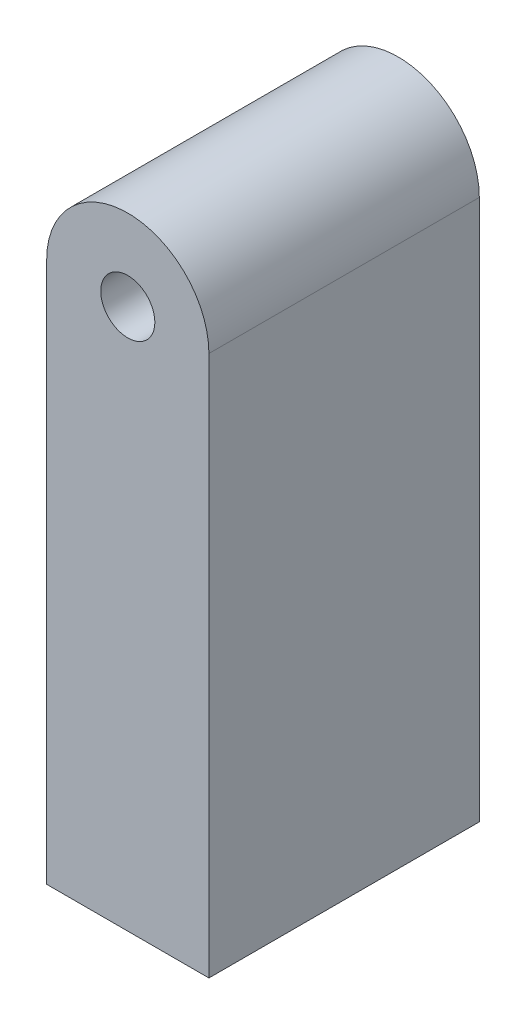
ISO-10303-21;
HEADER;
FILE_DESCRIPTION(('STEP AP214'),'2;1');
FILE_NAME('part.step','',(''),(''),'','','');
FILE_SCHEMA(('AUTOMOTIVE_DESIGN { 1 0 10303 214 1 1 1 1 }'));
ENDSEC;
DATA;
#1=APPLICATION_CONTEXT('core data for automotive mechanical design processes');
#2=APPLICATION_PROTOCOL_DEFINITION('international standard','automotive_design',2000,#1);
#3=PRODUCT_CONTEXT('',#1,'mechanical');
#4=PRODUCT('Part','Part','',(#3));
#5=PRODUCT_RELATED_PRODUCT_CATEGORY('part','',(#4));
#6=PRODUCT_DEFINITION_FORMATION('','',#4);
#7=PRODUCT_DEFINITION_CONTEXT('part definition',#1,'design');
#8=PRODUCT_DEFINITION('design','',#6,#7);
#9=PRODUCT_DEFINITION_SHAPE('','',#8);
#10=(LENGTH_UNIT() NAMED_UNIT(*) SI_UNIT(.MILLI.,.METRE.));
#11=(NAMED_UNIT(*) PLANE_ANGLE_UNIT() SI_UNIT($,.RADIAN.));
#12=(NAMED_UNIT(*) SI_UNIT($,.STERADIAN.) SOLID_ANGLE_UNIT());
#13=UNCERTAINTY_MEASURE_WITH_UNIT(LENGTH_MEASURE(1.E-05),#10,'distance_accuracy_value','');
#14=(GEOMETRIC_REPRESENTATION_CONTEXT(3) GLOBAL_UNCERTAINTY_ASSIGNED_CONTEXT((#13)) GLOBAL_UNIT_ASSIGNED_CONTEXT((#10,
#11,#12)) REPRESENTATION_CONTEXT('',''));
#15=CARTESIAN_POINT('',(0.,0.,0.));
#16=DIRECTION('',(0.,0.,1.));
#17=DIRECTION('',(1.,0.,0.));
#18=AXIS2_PLACEMENT_3D('',#15,#16,#17);
#19=CARTESIAN_POINT('',(0.,1.27,1.27));
#20=DIRECTION('',(0.,0.,-1.));
#21=DIRECTION('',(-1.,0.,0.));
#22=AXIS2_PLACEMENT_3D('',#19,#20,#21);
#23=CYLINDRICAL_SURFACE('',#22,0.381);
#24=CARTESIAN_POINT('',(0.,1.27,0.));
#25=DIRECTION('',(0.,0.,1.));
#26=DIRECTION('',(1.,0.,0.));
#27=AXIS2_PLACEMENT_3D('',#24,#25,#26);
#28=CIRCLE('',#27,0.381);
#29=CARTESIAN_POINT('',(0.381,1.27,0.));
#30=VERTEX_POINT('',#29);
#31=CARTESIAN_POINT('',(-0.381,1.27,0.));
#32=VERTEX_POINT('',#31);
#33=EDGE_CURVE('E116',#30,#32,#28,.T.);
#34=ORIENTED_EDGE('',*,*,#33,.T.);
#35=DIRECTION('',(0.,0.,-1.));
#36=VECTOR('',#35,1.);
#37=CARTESIAN_POINT('',(-0.381,1.27,1.27));
#38=LINE('',#37,#36);
#39=CARTESIAN_POINT('',(-0.381,1.27,1.27));
#40=VERTEX_POINT('',#39);
#41=EDGE_CURVE('E11',#40,#32,#38,.T.);
#42=ORIENTED_EDGE('',*,*,#41,.F.);
#43=CARTESIAN_POINT('',(0.,1.27,1.27));
#44=DIRECTION('',(0.,0.,1.));
#45=DIRECTION('',(1.,0.,0.));
#46=AXIS2_PLACEMENT_3D('',#43,#44,#45);
#47=CIRCLE('',#46,0.381);
#48=CARTESIAN_POINT('',(0.381,1.27,1.27));
#49=VERTEX_POINT('',#48);
#50=EDGE_CURVE('E84',#49,#40,#47,.T.);
#51=ORIENTED_EDGE('',*,*,#50,.F.);
#52=DIRECTION('',(0.,0.,-1.));
#53=VECTOR('',#52,1.);
#54=CARTESIAN_POINT('',(0.381,1.27,1.27));
#55=LINE('',#54,#53);
#56=EDGE_CURVE('E115',#49,#30,#55,.T.);
#57=ORIENTED_EDGE('',*,*,#56,.T.);
#58=EDGE_LOOP('',(#34,#42,#51,#57));
#59=FACE_BOUND('',#58,.T.);
#60=ADVANCED_FACE('F41',(#59),#23,.T.);
#61=CARTESIAN_POINT('',(-0.381,0.,1.27));
#62=DIRECTION('',(-1.,0.,0.));
#63=DIRECTION('',(0.,0.,1.));
#64=AXIS2_PLACEMENT_3D('',#61,#62,#63);
#65=PLANE('',#64);
#66=DIRECTION('',(0.,1.,0.));
#67=VECTOR('',#66,1.);
#68=CARTESIAN_POINT('',(-0.381,0.,0.));
#69=LINE('',#68,#67);
#70=CARTESIAN_POINT('',(-0.381,-1.27,0.));
#71=VERTEX_POINT('',#70);
#72=EDGE_CURVE('E94',#71,#32,#69,.T.);
#73=ORIENTED_EDGE('',*,*,#72,.F.);
#74=DIRECTION('',(0.,0.,-1.));
#75=VECTOR('',#74,1.);
#76=CARTESIAN_POINT('',(-0.381,-1.27,1.27));
#77=LINE('',#76,#75);
#78=CARTESIAN_POINT('',(-0.381,-1.27,1.27));
#79=VERTEX_POINT('',#78);
#80=EDGE_CURVE('E50',#79,#71,#77,.T.);
#81=ORIENTED_EDGE('',*,*,#80,.F.);
#82=DIRECTION('',(0.,1.,0.));
#83=VECTOR('',#82,1.);
#84=CARTESIAN_POINT('',(-0.381,0.,1.27));
#85=LINE('',#84,#83);
#86=EDGE_CURVE('E92',#79,#40,#85,.T.);
#87=ORIENTED_EDGE('',*,*,#86,.T.);
#88=ORIENTED_EDGE('',*,*,#41,.T.);
#89=EDGE_LOOP('',(#73,#81,#87,#88));
#90=FACE_BOUND('',#89,.T.);
#91=ADVANCED_FACE('F91',(#90),#65,.T.);
#92=CARTESIAN_POINT('',(0.,-1.27,1.27));
#93=DIRECTION('',(0.,1.,0.));
#94=DIRECTION('',(0.,0.,1.));
#95=AXIS2_PLACEMENT_3D('',#92,#93,#94);
#96=PLANE('',#95);
#97=DIRECTION('',(1.,0.,0.));
#98=VECTOR('',#97,1.);
#99=CARTESIAN_POINT('',(0.,-1.27,0.));
#100=LINE('',#99,#98);
#101=CARTESIAN_POINT('',(0.381,-1.27,0.));
#102=VERTEX_POINT('',#101);
#103=EDGE_CURVE('E73',#71,#102,#100,.T.);
#104=ORIENTED_EDGE('',*,*,#103,.T.);
#105=DIRECTION('',(0.,0.,-1.));
#106=VECTOR('',#105,1.);
#107=CARTESIAN_POINT('',(0.381,-1.27,1.27));
#108=LINE('',#107,#106);
#109=CARTESIAN_POINT('',(0.381,-1.27,1.27));
#110=VERTEX_POINT('',#109);
#111=EDGE_CURVE('E96',#110,#102,#108,.T.);
#112=ORIENTED_EDGE('',*,*,#111,.F.);
#113=DIRECTION('',(1.,0.,0.));
#114=VECTOR('',#113,1.);
#115=CARTESIAN_POINT('',(0.,-1.27,1.27));
#116=LINE('',#115,#114);
#117=EDGE_CURVE('E97',#79,#110,#116,.T.);
#118=ORIENTED_EDGE('',*,*,#117,.F.);
#119=ORIENTED_EDGE('',*,*,#80,.T.);
#120=EDGE_LOOP('',(#104,#112,#118,#119));
#121=FACE_BOUND('',#120,.T.);
#122=ADVANCED_FACE('F98',(#121),#96,.F.);
#123=CARTESIAN_POINT('',(0.381,0.,1.27));
#124=DIRECTION('',(-1.,0.,0.));
#125=DIRECTION('',(0.,0.,1.));
#126=AXIS2_PLACEMENT_3D('',#123,#124,#125);
#127=PLANE('',#126);
#128=DIRECTION('',(0.,1.,0.));
#129=VECTOR('',#128,1.);
#130=CARTESIAN_POINT('',(0.381,0.,0.));
#131=LINE('',#130,#129);
#132=EDGE_CURVE('E79',#102,#30,#131,.T.);
#133=ORIENTED_EDGE('',*,*,#132,.T.);
#134=ORIENTED_EDGE('',*,*,#56,.F.);
#135=DIRECTION('',(0.,1.,0.));
#136=VECTOR('',#135,1.);
#137=CARTESIAN_POINT('',(0.381,0.,1.27));
#138=LINE('',#137,#136);
#139=EDGE_CURVE('E58',#110,#49,#138,.T.);
#140=ORIENTED_EDGE('',*,*,#139,.F.);
#141=ORIENTED_EDGE('',*,*,#111,.T.);
#142=EDGE_LOOP('',(#133,#134,#140,#141));
#143=FACE_BOUND('',#142,.T.);
#144=ADVANCED_FACE('F132',(#143),#127,.F.);
#145=CARTESIAN_POINT('',(0.,1.27,1.27));
#146=DIRECTION('',(0.,0.,-1.));
#147=DIRECTION('',(-1.,0.,0.));
#148=AXIS2_PLACEMENT_3D('',#145,#146,#147);
#149=CYLINDRICAL_SURFACE('',#148,0.127);
#150=CARTESIAN_POINT('',(0.,1.27,1.27));
#151=DIRECTION('',(0.,0.,1.));
#152=DIRECTION('',(1.,0.,0.));
#153=AXIS2_PLACEMENT_3D('',#150,#151,#152);
#154=CIRCLE('',#153,0.127);
#155=CARTESIAN_POINT('',(0.127,1.27,1.27));
#156=VERTEX_POINT('',#155);
#157=EDGE_CURVE('E111',#156,#156,#154,.T.);
#158=ORIENTED_EDGE('',*,*,#157,.T.);
#159=EDGE_LOOP('',(#158));
#160=FACE_BOUND('',#159,.T.);
#161=CARTESIAN_POINT('',(0.,1.27,0.));
#162=DIRECTION('',(0.,0.,1.));
#163=DIRECTION('',(1.,0.,0.));
#164=AXIS2_PLACEMENT_3D('',#161,#162,#163);
#165=CIRCLE('',#164,0.127);
#166=CARTESIAN_POINT('',(0.127,1.27,0.));
#167=VERTEX_POINT('',#166);
#168=EDGE_CURVE('E106',#167,#167,#165,.T.);
#169=ORIENTED_EDGE('',*,*,#168,.F.);
#170=EDGE_LOOP('',(#169));
#171=FACE_BOUND('',#170,.T.);
#172=ADVANCED_FACE('F149',(#160,#171),#149,.F.);
#173=CARTESIAN_POINT('',(0.,0.,1.27));
#174=DIRECTION('',(0.,0.,1.));
#175=DIRECTION('',(1.,0.,0.));
#176=AXIS2_PLACEMENT_3D('',#173,#174,#175);
#177=PLANE('',#176);
#178=ORIENTED_EDGE('',*,*,#50,.T.);
#179=ORIENTED_EDGE('',*,*,#86,.F.);
#180=ORIENTED_EDGE('',*,*,#117,.T.);
#181=ORIENTED_EDGE('',*,*,#139,.T.);
#182=EDGE_LOOP('',(#178,#179,#180,#181));
#183=FACE_BOUND('',#182,.T.);
#184=ORIENTED_EDGE('',*,*,#157,.F.);
#185=EDGE_LOOP('',(#184));
#186=FACE_BOUND('',#185,.T.);
#187=ADVANCED_FACE('F101',(#183,#186),#177,.T.);
#188=CARTESIAN_POINT('',(0.,0.,0.));
#189=DIRECTION('',(0.,0.,1.));
#190=DIRECTION('',(1.,0.,0.));
#191=AXIS2_PLACEMENT_3D('',#188,#189,#190);
#192=PLANE('',#191);
#193=ORIENTED_EDGE('',*,*,#33,.F.);
#194=ORIENTED_EDGE('',*,*,#132,.F.);
#195=ORIENTED_EDGE('',*,*,#103,.F.);
#196=ORIENTED_EDGE('',*,*,#72,.T.);
#197=EDGE_LOOP('',(#193,#194,#195,#196));
#198=FACE_BOUND('',#197,.T.);
#199=ORIENTED_EDGE('',*,*,#168,.T.);
#200=EDGE_LOOP('',(#199));
#201=FACE_BOUND('',#200,.T.);
#202=ADVANCED_FACE('F135',(#198,#201),#192,.F.);
#203=CLOSED_SHELL('',(#60,#91,#122,#144,#172,#187,#202));
#204=MANIFOLD_SOLID_BREP('B2',#203);
#205=ADVANCED_BREP_SHAPE_REPRESENTATION('',(#18,#204),#14);
#206=SHAPE_DEFINITION_REPRESENTATION(#9,#205);
ENDSEC;
END-ISO-10303-21;
